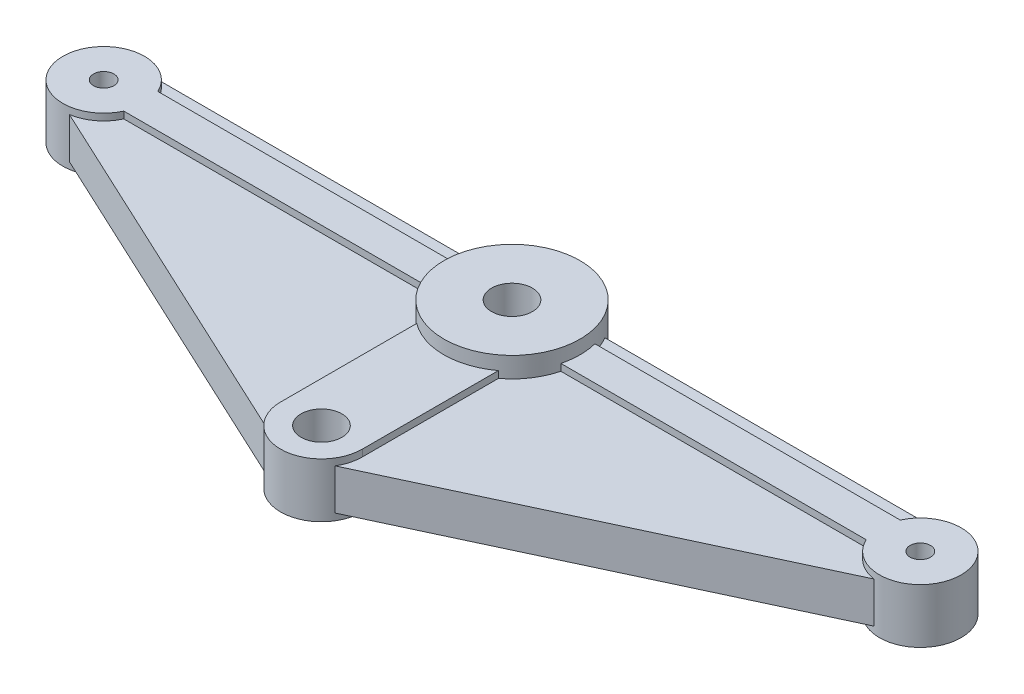
ISO-10303-21;
HEADER;
FILE_DESCRIPTION(('STEP AP214'),'2;1');
FILE_NAME('part.step','',(''),(''),'','','');
FILE_SCHEMA(('AUTOMOTIVE_DESIGN { 1 0 10303 214 1 1 1 1 }'));
ENDSEC;
DATA;
#1=APPLICATION_CONTEXT('core data for automotive mechanical design processes');
#2=APPLICATION_PROTOCOL_DEFINITION('international standard','automotive_design',2000,#1);
#3=PRODUCT_CONTEXT('',#1,'mechanical');
#4=PRODUCT('Part','Part','',(#3));
#5=PRODUCT_RELATED_PRODUCT_CATEGORY('part','',(#4));
#6=PRODUCT_DEFINITION_FORMATION('','',#4);
#7=PRODUCT_DEFINITION_CONTEXT('part definition',#1,'design');
#8=PRODUCT_DEFINITION('design','',#6,#7);
#9=PRODUCT_DEFINITION_SHAPE('','',#8);
#10=(LENGTH_UNIT() NAMED_UNIT(*) SI_UNIT(.MILLI.,.METRE.));
#11=(NAMED_UNIT(*) PLANE_ANGLE_UNIT() SI_UNIT($,.RADIAN.));
#12=(NAMED_UNIT(*) SI_UNIT($,.STERADIAN.) SOLID_ANGLE_UNIT());
#13=UNCERTAINTY_MEASURE_WITH_UNIT(LENGTH_MEASURE(1.E-05),#10,'distance_accuracy_value','');
#14=(GEOMETRIC_REPRESENTATION_CONTEXT(3) GLOBAL_UNCERTAINTY_ASSIGNED_CONTEXT((#13)) GLOBAL_UNIT_ASSIGNED_CONTEXT((#10,
#11,#12)) REPRESENTATION_CONTEXT('',''));
#15=CARTESIAN_POINT('',(0.,0.,0.));
#16=DIRECTION('',(0.,0.,1.));
#17=DIRECTION('',(1.,0.,0.));
#18=AXIS2_PLACEMENT_3D('',#15,#16,#17);
#19=CARTESIAN_POINT('',(-30.,1.5,0.));
#20=DIRECTION('',(0.,1.,0.));
#21=DIRECTION('',(0.,0.,1.));
#22=AXIS2_PLACEMENT_3D('',#19,#20,#21);
#23=PLANE('',#22);
#24=DIRECTION('',(1.,0.,0.));
#25=VECTOR('',#24,1.);
#26=CARTESIAN_POINT('',(-30.,1.5,-1.25));
#27=LINE('',#26,#25);
#28=CARTESIAN_POINT('',(-27.2728219713411,1.5,-1.25));
#29=VERTEX_POINT('',#28);
#30=CARTESIAN_POINT('',(-4.84122918275927,1.5,-1.25));
#31=VERTEX_POINT('',#30);
#32=EDGE_CURVE('E334',#29,#31,#27,.T.);
#33=ORIENTED_EDGE('',*,*,#32,.T.);
#34=CARTESIAN_POINT('',(0.,1.5,0.));
#35=DIRECTION('',(0.,1.,0.));
#36=DIRECTION('',(0.,0.,1.));
#37=AXIS2_PLACEMENT_3D('',#34,#35,#36);
#38=CIRCLE('',#37,5.);
#39=CARTESIAN_POINT('',(-4.33012701892219,1.5,-2.50000000000001));
#40=VERTEX_POINT('',#39);
#41=EDGE_CURVE('E492',#31,#40,#38,.F.);
#42=ORIENTED_EDGE('',*,*,#41,.T.);
#43=DIRECTION('',(-1.,0.,0.));
#44=VECTOR('',#43,1.);
#45=CARTESIAN_POINT('',(-30.,1.5,-2.50000000000001));
#46=LINE('',#45,#44);
#47=CARTESIAN_POINT('',(-28.3416876048223,1.5,-2.50000000000001));
#48=VERTEX_POINT('',#47);
#49=EDGE_CURVE('E275',#40,#48,#46,.T.);
#50=ORIENTED_EDGE('',*,*,#49,.T.);
#51=CARTESIAN_POINT('',(-30.,1.5,0.));
#52=DIRECTION('',(0.,1.,0.));
#53=DIRECTION('',(0.,0.,1.));
#54=AXIS2_PLACEMENT_3D('',#51,#52,#53);
#55=CIRCLE('',#54,3.);
#56=EDGE_CURVE('E353',#48,#29,#55,.F.);
#57=ORIENTED_EDGE('',*,*,#56,.T.);
#58=EDGE_LOOP('',(#33,#42,#50,#57));
#59=FACE_BOUND('',#58,.T.);
#60=ADVANCED_FACE('F31',(#59),#23,.T.);
#61=CARTESIAN_POINT('',(28.3416876048223,1.5,-2.50000000000001));
#62=VERTEX_POINT('',#61);
#63=CARTESIAN_POINT('',(4.33012701892219,1.5,-2.50000000000001));
#64=VERTEX_POINT('',#63);
#65=EDGE_CURVE('E276',#62,#64,#46,.T.);
#66=ORIENTED_EDGE('',*,*,#65,.T.);
#67=CARTESIAN_POINT('',(4.84122918275927,1.5,-1.25));
#68=VERTEX_POINT('',#67);
#69=EDGE_CURVE('E478',#64,#68,#38,.F.);
#70=ORIENTED_EDGE('',*,*,#69,.T.);
#71=DIRECTION('',(1.,0.,0.));
#72=VECTOR('',#71,1.);
#73=CARTESIAN_POINT('',(-30.,1.5,-1.25));
#74=LINE('',#73,#72);
#75=CARTESIAN_POINT('',(27.2728219713411,1.5,-1.25));
#76=VERTEX_POINT('',#75);
#77=EDGE_CURVE('E339',#68,#76,#74,.T.);
#78=ORIENTED_EDGE('',*,*,#77,.T.);
#79=CARTESIAN_POINT('',(30.,1.5,0.));
#80=DIRECTION('',(0.,1.,0.));
#81=DIRECTION('',(0.,0.,1.));
#82=AXIS2_PLACEMENT_3D('',#79,#80,#81);
#83=CIRCLE('',#82,3.);
#84=EDGE_CURVE('E344',#76,#62,#83,.F.);
#85=ORIENTED_EDGE('',*,*,#84,.T.);
#86=EDGE_LOOP('',(#66,#70,#78,#85));
#87=FACE_BOUND('',#86,.T.);
#88=ADVANCED_FACE('F530',(#87),#23,.T.);
#89=CARTESIAN_POINT('',(-30.,-1.5,0.));
#90=DIRECTION('',(0.,1.,0.));
#91=DIRECTION('',(0.,0.,1.));
#92=AXIS2_PLACEMENT_3D('',#89,#90,#91);
#93=PLANE('',#92);
#94=CARTESIAN_POINT('',(0.,-1.5,0.));
#95=DIRECTION('',(0.,1.,0.));
#96=DIRECTION('',(0.,0.,1.));
#97=AXIS2_PLACEMENT_3D('',#94,#95,#96);
#98=CIRCLE('',#97,5.);
#99=CARTESIAN_POINT('',(-4.84122918275927,-1.5,-1.25));
#100=VERTEX_POINT('',#99);
#101=CARTESIAN_POINT('',(-4.33012701892219,-1.5,-2.50000000000001));
#102=VERTEX_POINT('',#101);
#103=EDGE_CURVE('E483',#100,#102,#98,.F.);
#104=ORIENTED_EDGE('',*,*,#103,.F.);
#105=DIRECTION('',(1.,0.,0.));
#106=VECTOR('',#105,1.);
#107=CARTESIAN_POINT('',(-30.,-1.5,-1.25));
#108=LINE('',#107,#106);
#109=CARTESIAN_POINT('',(-27.2728219713411,-1.5,-1.25));
#110=VERTEX_POINT('',#109);
#111=EDGE_CURVE('E327',#110,#100,#108,.T.);
#112=ORIENTED_EDGE('',*,*,#111,.F.);
#113=CARTESIAN_POINT('',(-30.,-1.5,0.));
#114=DIRECTION('',(0.,1.,0.));
#115=DIRECTION('',(0.,0.,1.));
#116=AXIS2_PLACEMENT_3D('',#113,#114,#115);
#117=CIRCLE('',#116,3.);
#118=CARTESIAN_POINT('',(-28.3416876048223,-1.5,-2.50000000000001));
#119=VERTEX_POINT('',#118);
#120=EDGE_CURVE('E317',#119,#110,#117,.F.);
#121=ORIENTED_EDGE('',*,*,#120,.F.);
#122=DIRECTION('',(-1.,0.,0.));
#123=VECTOR('',#122,1.);
#124=CARTESIAN_POINT('',(-30.,-1.5,-2.50000000000001));
#125=LINE('',#124,#123);
#126=EDGE_CURVE('E266',#102,#119,#125,.T.);
#127=ORIENTED_EDGE('',*,*,#126,.F.);
#128=EDGE_LOOP('',(#104,#112,#121,#127));
#129=FACE_BOUND('',#128,.T.);
#130=ADVANCED_FACE('F536',(#129),#93,.F.);
#131=CARTESIAN_POINT('',(4.33012701892219,-1.5,-2.50000000000001));
#132=VERTEX_POINT('',#131);
#133=CARTESIAN_POINT('',(4.84122918275927,-1.5,-1.25));
#134=VERTEX_POINT('',#133);
#135=EDGE_CURVE('E472',#132,#134,#98,.F.);
#136=ORIENTED_EDGE('',*,*,#135,.F.);
#137=CARTESIAN_POINT('',(28.3416876048223,-1.5,-2.50000000000001));
#138=VERTEX_POINT('',#137);
#139=EDGE_CURVE('E267',#138,#132,#125,.T.);
#140=ORIENTED_EDGE('',*,*,#139,.F.);
#141=CARTESIAN_POINT('',(30.,-1.5,0.));
#142=DIRECTION('',(0.,1.,0.));
#143=DIRECTION('',(0.,0.,1.));
#144=AXIS2_PLACEMENT_3D('',#141,#142,#143);
#145=CIRCLE('',#144,3.);
#146=CARTESIAN_POINT('',(27.2728219713411,-1.5,-1.25));
#147=VERTEX_POINT('',#146);
#148=EDGE_CURVE('E341',#147,#138,#145,.F.);
#149=ORIENTED_EDGE('',*,*,#148,.F.);
#150=DIRECTION('',(1.,0.,0.));
#151=VECTOR('',#150,1.);
#152=CARTESIAN_POINT('',(-30.,-1.5,-1.25));
#153=LINE('',#152,#151);
#154=EDGE_CURVE('E337',#134,#147,#153,.T.);
#155=ORIENTED_EDGE('',*,*,#154,.F.);
#156=EDGE_LOOP('',(#136,#140,#149,#155));
#157=FACE_BOUND('',#156,.T.);
#158=ADVANCED_FACE('F553',(#157),#93,.F.);
#159=CARTESIAN_POINT('',(-30.,1.5,-2.50000000000001));
#160=DIRECTION('',(0.,0.,1.));
#161=DIRECTION('',(1.,0.,0.));
#162=AXIS2_PLACEMENT_3D('',#159,#160,#161);
#163=PLANE('',#162);
#164=DIRECTION('',(0.,-1.,0.));
#165=VECTOR('',#164,1.);
#166=CARTESIAN_POINT('',(-4.33012701892219,3.,-2.50000000000001));
#167=LINE('',#166,#165);
#168=EDGE_CURVE('E485',#102,#40,#167,.F.);
#169=ORIENTED_EDGE('',*,*,#168,.F.);
#170=ORIENTED_EDGE('',*,*,#126,.T.);
#171=DIRECTION('',(0.,-1.,0.));
#172=VECTOR('',#171,1.);
#173=CARTESIAN_POINT('',(-28.3416876048223,2.,-2.50000000000001));
#174=LINE('',#173,#172);
#175=EDGE_CURVE('E282',#48,#119,#174,.T.);
#176=ORIENTED_EDGE('',*,*,#175,.F.);
#177=ORIENTED_EDGE('',*,*,#49,.F.);
#178=EDGE_LOOP('',(#169,#170,#176,#177));
#179=FACE_BOUND('',#178,.T.);
#180=ADVANCED_FACE('F564',(#179),#163,.F.);
#181=DIRECTION('',(0.,-1.,0.));
#182=VECTOR('',#181,1.);
#183=CARTESIAN_POINT('',(4.33012701892219,3.,-2.50000000000001));
#184=LINE('',#183,#182);
#185=EDGE_CURVE('E473',#64,#132,#184,.T.);
#186=ORIENTED_EDGE('',*,*,#185,.F.);
#187=ORIENTED_EDGE('',*,*,#65,.F.);
#188=DIRECTION('',(0.,-1.,0.));
#189=VECTOR('',#188,1.);
#190=CARTESIAN_POINT('',(28.3416876048223,2.,-2.50000000000001));
#191=LINE('',#190,#189);
#192=EDGE_CURVE('E279',#138,#62,#191,.F.);
#193=ORIENTED_EDGE('',*,*,#192,.F.);
#194=ORIENTED_EDGE('',*,*,#139,.T.);
#195=EDGE_LOOP('',(#186,#187,#193,#194));
#196=FACE_BOUND('',#195,.T.);
#197=ADVANCED_FACE('F570',(#196),#163,.F.);
#198=CARTESIAN_POINT('',(-27.2728219713411,2.,1.25));
#199=DIRECTION('',(0.,0.,-1.));
#200=DIRECTION('',(-1.,0.,0.));
#201=AXIS2_PLACEMENT_3D('',#198,#199,#200);
#202=PLANE('',#201);
#203=DIRECTION('',(0.,-1.,0.));
#204=VECTOR('',#203,1.);
#205=CARTESIAN_POINT('',(-4.84122918275927,3.,1.25));
#206=LINE('',#205,#204);
#207=CARTESIAN_POINT('',(-4.84122918275927,-1.5,1.25));
#208=VERTEX_POINT('',#207);
#209=CARTESIAN_POINT('',(-4.84122918275927,-2.,1.25));
#210=VERTEX_POINT('',#209);
#211=EDGE_CURVE('E304',#208,#210,#206,.T.);
#212=ORIENTED_EDGE('',*,*,#211,.F.);
#213=DIRECTION('',(-1.,0.,0.));
#214=VECTOR('',#213,1.);
#215=CARTESIAN_POINT('',(-30.,-1.5,1.25));
#216=LINE('',#215,#214);
#217=CARTESIAN_POINT('',(-27.2728219713411,-1.5,1.25));
#218=VERTEX_POINT('',#217);
#219=EDGE_CURVE('E39',#208,#218,#216,.T.);
#220=ORIENTED_EDGE('',*,*,#219,.T.);
#221=DIRECTION('',(0.,-1.,0.));
#222=VECTOR('',#221,1.);
#223=CARTESIAN_POINT('',(-27.2728219713411,2.,1.25));
#224=LINE('',#223,#222);
#225=CARTESIAN_POINT('',(-27.2728219713411,-2.,1.25));
#226=VERTEX_POINT('',#225);
#227=EDGE_CURVE('E302',#218,#226,#224,.T.);
#228=ORIENTED_EDGE('',*,*,#227,.T.);
#229=DIRECTION('',(1.,0.,0.));
#230=VECTOR('',#229,1.);
#231=CARTESIAN_POINT('',(-27.2728219713411,-2.,1.25));
#232=LINE('',#231,#230);
#233=EDGE_CURVE('E437',#226,#210,#232,.T.);
#234=ORIENTED_EDGE('',*,*,#233,.T.);
#235=EDGE_LOOP('',(#212,#220,#228,#234));
#236=FACE_BOUND('',#235,.T.);
#237=ADVANCED_FACE('F299',(#236),#202,.F.);
#238=CARTESIAN_POINT('',(-3.,2.,1.25));
#239=DIRECTION('',(1.,0.,0.));
#240=DIRECTION('',(0.,0.,-1.));
#241=AXIS2_PLACEMENT_3D('',#238,#239,#240);
#242=PLANE('',#241);
#243=DIRECTION('',(0.,-1.,0.));
#244=VECTOR('',#243,1.);
#245=CARTESIAN_POINT('',(-3.,3.,4.));
#246=LINE('',#245,#244);
#247=CARTESIAN_POINT('',(-3.,-2.,4.));
#248=VERTEX_POINT('',#247);
#249=CARTESIAN_POINT('',(-3.,-1.5,4.));
#250=VERTEX_POINT('',#249);
#251=EDGE_CURVE('E465',#248,#250,#246,.F.);
#252=ORIENTED_EDGE('',*,*,#251,.F.);
#253=DIRECTION('',(0.,0.,1.));
#254=VECTOR('',#253,1.);
#255=CARTESIAN_POINT('',(-3.,-2.,1.25));
#256=LINE('',#255,#254);
#257=CARTESIAN_POINT('',(-3.,-2.,14.));
#258=VERTEX_POINT('',#257);
#259=EDGE_CURVE('E379',#248,#258,#256,.T.);
#260=ORIENTED_EDGE('',*,*,#259,.T.);
#261=DIRECTION('',(0.,-1.,0.));
#262=VECTOR('',#261,1.);
#263=CARTESIAN_POINT('',(-3.,2.,14.));
#264=LINE('',#263,#262);
#265=CARTESIAN_POINT('',(-3.,-1.5,14.));
#266=VERTEX_POINT('',#265);
#267=EDGE_CURVE('E328',#266,#258,#264,.T.);
#268=ORIENTED_EDGE('',*,*,#267,.F.);
#269=DIRECTION('',(0.,0.,-1.));
#270=VECTOR('',#269,1.);
#271=CARTESIAN_POINT('',(-3.,-1.5,0.));
#272=LINE('',#271,#270);
#273=EDGE_CURVE('E293',#266,#250,#272,.T.);
#274=ORIENTED_EDGE('',*,*,#273,.T.);
#275=EDGE_LOOP('',(#252,#260,#268,#274));
#276=FACE_BOUND('',#275,.T.);
#277=ADVANCED_FACE('F377',(#276),#242,.F.);
#278=CARTESIAN_POINT('',(3.,2.,1.25));
#279=DIRECTION('',(-1.,0.,0.));
#280=DIRECTION('',(0.,0.,1.));
#281=AXIS2_PLACEMENT_3D('',#278,#279,#280);
#282=PLANE('',#281);
#283=DIRECTION('',(0.,-1.,0.));
#284=VECTOR('',#283,1.);
#285=CARTESIAN_POINT('',(3.,3.,4.));
#286=LINE('',#285,#284);
#287=CARTESIAN_POINT('',(3.,-1.5,4.));
#288=VERTEX_POINT('',#287);
#289=CARTESIAN_POINT('',(3.,-2.,4.));
#290=VERTEX_POINT('',#289);
#291=EDGE_CURVE('E460',#288,#290,#286,.T.);
#292=ORIENTED_EDGE('',*,*,#291,.F.);
#293=DIRECTION('',(0.,0.,1.));
#294=VECTOR('',#293,1.);
#295=CARTESIAN_POINT('',(3.,-1.5,0.));
#296=LINE('',#295,#294);
#297=CARTESIAN_POINT('',(3.,-1.5,14.));
#298=VERTEX_POINT('',#297);
#299=EDGE_CURVE('E291',#288,#298,#296,.T.);
#300=ORIENTED_EDGE('',*,*,#299,.T.);
#301=DIRECTION('',(0.,-1.,0.));
#302=VECTOR('',#301,1.);
#303=CARTESIAN_POINT('',(3.,2.,14.));
#304=LINE('',#303,#302);
#305=CARTESIAN_POINT('',(3.,-2.,14.));
#306=VERTEX_POINT('',#305);
#307=EDGE_CURVE('E382',#298,#306,#304,.T.);
#308=ORIENTED_EDGE('',*,*,#307,.T.);
#309=DIRECTION('',(0.,0.,-1.));
#310=VECTOR('',#309,1.);
#311=CARTESIAN_POINT('',(3.,-2.,1.25));
#312=LINE('',#311,#310);
#313=EDGE_CURVE('E431',#306,#290,#312,.T.);
#314=ORIENTED_EDGE('',*,*,#313,.T.);
#315=EDGE_LOOP('',(#292,#300,#308,#314));
#316=FACE_BOUND('',#315,.T.);
#317=ADVANCED_FACE('F604',(#316),#282,.F.);
#318=CARTESIAN_POINT('',(3.,2.,1.25));
#319=DIRECTION('',(0.,0.,-1.));
#320=DIRECTION('',(-1.,0.,0.));
#321=AXIS2_PLACEMENT_3D('',#318,#319,#320);
#322=PLANE('',#321);
#323=DIRECTION('',(0.,-1.,0.));
#324=VECTOR('',#323,1.);
#325=CARTESIAN_POINT('',(4.84122918275927,3.,1.25));
#326=LINE('',#325,#324);
#327=CARTESIAN_POINT('',(4.84122918275927,-2.,1.25));
#328=VERTEX_POINT('',#327);
#329=CARTESIAN_POINT('',(4.84122918275927,-1.5,1.25));
#330=VERTEX_POINT('',#329);
#331=EDGE_CURVE('E462',#328,#330,#326,.F.);
#332=ORIENTED_EDGE('',*,*,#331,.F.);
#333=DIRECTION('',(1.,0.,0.));
#334=VECTOR('',#333,1.);
#335=CARTESIAN_POINT('',(3.,-2.,1.25));
#336=LINE('',#335,#334);
#337=CARTESIAN_POINT('',(27.2728219713411,-2.,1.25));
#338=VERTEX_POINT('',#337);
#339=EDGE_CURVE('E429',#328,#338,#336,.T.);
#340=ORIENTED_EDGE('',*,*,#339,.T.);
#341=DIRECTION('',(0.,-1.,0.));
#342=VECTOR('',#341,1.);
#343=CARTESIAN_POINT('',(27.2728219713411,2.,1.25));
#344=LINE('',#343,#342);
#345=CARTESIAN_POINT('',(27.2728219713411,-1.5,1.25));
#346=VERTEX_POINT('',#345);
#347=EDGE_CURVE('E391',#346,#338,#344,.T.);
#348=ORIENTED_EDGE('',*,*,#347,.F.);
#349=DIRECTION('',(-1.,0.,0.));
#350=VECTOR('',#349,1.);
#351=CARTESIAN_POINT('',(-30.,-1.5,1.25));
#352=LINE('',#351,#350);
#353=EDGE_CURVE('E288',#346,#330,#352,.T.);
#354=ORIENTED_EDGE('',*,*,#353,.T.);
#355=EDGE_LOOP('',(#332,#340,#348,#354));
#356=FACE_BOUND('',#355,.T.);
#357=ADVANCED_FACE('F667',(#356),#322,.F.);
#358=CARTESIAN_POINT('',(0.829156197588851,2.,-1.25));
#359=DIRECTION('',(0.,0.,1.));
#360=DIRECTION('',(1.,0.,0.));
#361=AXIS2_PLACEMENT_3D('',#358,#359,#360);
#362=PLANE('',#361);
#363=DIRECTION('',(0.,-1.,0.));
#364=VECTOR('',#363,1.);
#365=CARTESIAN_POINT('',(4.84122918275927,3.,-1.25));
#366=LINE('',#365,#364);
#367=CARTESIAN_POINT('',(4.84122918275927,-2.,-1.25));
#368=VERTEX_POINT('',#367);
#369=EDGE_CURVE('E468',#134,#368,#366,.T.);
#370=ORIENTED_EDGE('',*,*,#369,.F.);
#371=ORIENTED_EDGE('',*,*,#154,.T.);
#372=DIRECTION('',(0.,-1.,0.));
#373=VECTOR('',#372,1.);
#374=CARTESIAN_POINT('',(27.2728219713411,2.,-1.25));
#375=LINE('',#374,#373);
#376=CARTESIAN_POINT('',(27.2728219713411,-2.,-1.25));
#377=VERTEX_POINT('',#376);
#378=EDGE_CURVE('E395',#147,#377,#375,.T.);
#379=ORIENTED_EDGE('',*,*,#378,.T.);
#380=DIRECTION('',(-1.,0.,0.));
#381=VECTOR('',#380,1.);
#382=CARTESIAN_POINT('',(0.829156197588851,-2.,-1.25));
#383=LINE('',#382,#381);
#384=EDGE_CURVE('E423',#377,#368,#383,.T.);
#385=ORIENTED_EDGE('',*,*,#384,.T.);
#386=EDGE_LOOP('',(#370,#371,#379,#385));
#387=FACE_BOUND('',#386,.T.);
#388=ADVANCED_FACE('F590',(#387),#362,.F.);
#389=CARTESIAN_POINT('',(-27.2728219713411,2.,-1.25));
#390=DIRECTION('',(0.,0.,1.));
#391=DIRECTION('',(1.,0.,0.));
#392=AXIS2_PLACEMENT_3D('',#389,#390,#391);
#393=PLANE('',#392);
#394=DIRECTION('',(0.,-1.,0.));
#395=VECTOR('',#394,1.);
#396=CARTESIAN_POINT('',(-4.84122918275927,3.,-1.25));
#397=LINE('',#396,#395);
#398=CARTESIAN_POINT('',(-4.84122918275927,-2.,-1.25));
#399=VERTEX_POINT('',#398);
#400=EDGE_CURVE('E479',#399,#100,#397,.F.);
#401=ORIENTED_EDGE('',*,*,#400,.F.);
#402=DIRECTION('',(-1.,0.,0.));
#403=VECTOR('',#402,1.);
#404=CARTESIAN_POINT('',(-27.2728219713411,-2.,-1.25));
#405=LINE('',#404,#403);
#406=CARTESIAN_POINT('',(-27.2728219713411,-2.,-1.25));
#407=VERTEX_POINT('',#406);
#408=EDGE_CURVE('E421',#399,#407,#405,.T.);
#409=ORIENTED_EDGE('',*,*,#408,.T.);
#410=DIRECTION('',(0.,-1.,0.));
#411=VECTOR('',#410,1.);
#412=CARTESIAN_POINT('',(-27.2728219713411,2.,-1.25));
#413=LINE('',#412,#411);
#414=EDGE_CURVE('E399',#110,#407,#413,.T.);
#415=ORIENTED_EDGE('',*,*,#414,.F.);
#416=ORIENTED_EDGE('',*,*,#111,.T.);
#417=EDGE_LOOP('',(#401,#409,#415,#416));
#418=FACE_BOUND('',#417,.T.);
#419=ADVANCED_FACE('F560',(#418),#393,.F.);
#420=CARTESIAN_POINT('',(-30.,2.,0.));
#421=DIRECTION('',(0.,1.,0.));
#422=DIRECTION('',(0.,0.,1.));
#423=AXIS2_PLACEMENT_3D('',#420,#421,#422);
#424=PLANE('',#423);
#425=CARTESIAN_POINT('',(-30.,2.,0.));
#426=DIRECTION('',(0.,1.,0.));
#427=DIRECTION('',(0.,0.,1.));
#428=AXIS2_PLACEMENT_3D('',#425,#426,#427);
#429=CIRCLE('',#428,0.750000000000002);
#430=CARTESIAN_POINT('',(-30.,2.,0.750000000000002));
#431=VERTEX_POINT('',#430);
#432=EDGE_CURVE('E452',#431,#431,#429,.T.);
#433=ORIENTED_EDGE('',*,*,#432,.F.);
#434=EDGE_LOOP('',(#433));
#435=FACE_BOUND('',#434,.T.);
#436=DIRECTION('',(1.,0.,0.));
#437=VECTOR('',#436,1.);
#438=CARTESIAN_POINT('',(-27.2728219713411,2.,1.25));
#439=LINE('',#438,#437);
#440=CARTESIAN_POINT('',(-27.2728219713411,2.,1.25));
#441=VERTEX_POINT('',#440);
#442=CARTESIAN_POINT('',(-4.84122918275927,2.,1.25));
#443=VERTEX_POINT('',#442);
#444=EDGE_CURVE('E415',#441,#443,#439,.T.);
#445=ORIENTED_EDGE('',*,*,#444,.T.);
#446=CARTESIAN_POINT('',(0.,2.,0.));
#447=DIRECTION('',(0.,1.,0.));
#448=DIRECTION('',(0.,0.,1.));
#449=AXIS2_PLACEMENT_3D('',#446,#447,#448);
#450=CIRCLE('',#449,5.);
#451=CARTESIAN_POINT('',(-4.84122918275927,2.,-1.25));
#452=VERTEX_POINT('',#451);
#453=EDGE_CURVE('E499',#443,#452,#450,.F.);
#454=ORIENTED_EDGE('',*,*,#453,.T.);
#455=DIRECTION('',(-1.,0.,0.));
#456=VECTOR('',#455,1.);
#457=CARTESIAN_POINT('',(-27.2728219713411,2.,-1.25));
#458=LINE('',#457,#456);
#459=CARTESIAN_POINT('',(-27.2728219713411,2.,-1.25));
#460=VERTEX_POINT('',#459);
#461=EDGE_CURVE('E400',#452,#460,#458,.T.);
#462=ORIENTED_EDGE('',*,*,#461,.T.);
#463=CARTESIAN_POINT('',(-30.,2.,0.));
#464=DIRECTION('',(0.,1.,0.));
#465=DIRECTION('',(0.,0.,1.));
#466=AXIS2_PLACEMENT_3D('',#463,#464,#465);
#467=CIRCLE('',#466,3.);
#468=EDGE_CURVE('E418',#460,#441,#467,.T.);
#469=ORIENTED_EDGE('',*,*,#468,.T.);
#470=EDGE_LOOP('',(#445,#454,#462,#469));
#471=FACE_BOUND('',#470,.T.);
#472=ADVANCED_FACE('F623',(#435,#471),#424,.T.);
#473=CARTESIAN_POINT('',(30.,2.,0.));
#474=DIRECTION('',(0.,1.,0.));
#475=DIRECTION('',(0.,0.,1.));
#476=AXIS2_PLACEMENT_3D('',#473,#474,#475);
#477=CIRCLE('',#476,0.750000000000002);
#478=CARTESIAN_POINT('',(30.,2.,0.749999999999995));
#479=VERTEX_POINT('',#478);
#480=EDGE_CURVE('E440',#479,#479,#477,.T.);
#481=ORIENTED_EDGE('',*,*,#480,.F.);
#482=EDGE_LOOP('',(#481));
#483=FACE_BOUND('',#482,.T.);
#484=DIRECTION('',(-1.,0.,0.));
#485=VECTOR('',#484,1.);
#486=CARTESIAN_POINT('',(0.829156197588851,2.,-1.25));
#487=LINE('',#486,#485);
#488=CARTESIAN_POINT('',(27.2728219713411,2.,-1.25));
#489=VERTEX_POINT('',#488);
#490=CARTESIAN_POINT('',(4.84122918275927,2.,-1.25));
#491=VERTEX_POINT('',#490);
#492=EDGE_CURVE('E402',#489,#491,#487,.T.);
#493=ORIENTED_EDGE('',*,*,#492,.T.);
#494=CARTESIAN_POINT('',(4.84122918275927,2.,1.25));
#495=VERTEX_POINT('',#494);
#496=EDGE_CURVE('E487',#491,#495,#450,.F.);
#497=ORIENTED_EDGE('',*,*,#496,.T.);
#498=DIRECTION('',(1.,0.,0.));
#499=VECTOR('',#498,1.);
#500=CARTESIAN_POINT('',(3.,2.,1.25));
#501=LINE('',#500,#499);
#502=CARTESIAN_POINT('',(27.2728219713411,2.,1.25));
#503=VERTEX_POINT('',#502);
#504=EDGE_CURVE('E407',#495,#503,#501,.T.);
#505=ORIENTED_EDGE('',*,*,#504,.T.);
#506=CARTESIAN_POINT('',(30.,2.,0.));
#507=DIRECTION('',(0.,1.,0.));
#508=DIRECTION('',(0.,0.,1.));
#509=AXIS2_PLACEMENT_3D('',#506,#507,#508);
#510=CIRCLE('',#509,3.);
#511=EDGE_CURVE('E405',#503,#489,#510,.T.);
#512=ORIENTED_EDGE('',*,*,#511,.T.);
#513=EDGE_LOOP('',(#493,#497,#505,#512));
#514=FACE_BOUND('',#513,.T.);
#515=ADVANCED_FACE('F620',(#483,#514),#424,.T.);
#516=CARTESIAN_POINT('',(0.,2.,14.));
#517=DIRECTION('',(0.,1.,0.));
#518=DIRECTION('',(0.,0.,1.));
#519=AXIS2_PLACEMENT_3D('',#516,#517,#518);
#520=CIRCLE('',#519,1.5);
#521=CARTESIAN_POINT('',(0.,2.,15.5));
#522=VERTEX_POINT('',#521);
#523=EDGE_CURVE('E446',#522,#522,#520,.T.);
#524=ORIENTED_EDGE('',*,*,#523,.F.);
#525=EDGE_LOOP('',(#524));
#526=FACE_BOUND('',#525,.T.);
#527=DIRECTION('',(0.,0.,-1.));
#528=VECTOR('',#527,1.);
#529=CARTESIAN_POINT('',(3.,2.,1.25));
#530=LINE('',#529,#528);
#531=CARTESIAN_POINT('',(3.,2.,14.));
#532=VERTEX_POINT('',#531);
#533=CARTESIAN_POINT('',(3.,2.,4.));
#534=VERTEX_POINT('',#533);
#535=EDGE_CURVE('E409',#532,#534,#530,.T.);
#536=ORIENTED_EDGE('',*,*,#535,.T.);
#537=CARTESIAN_POINT('',(-3.,2.,4.));
#538=VERTEX_POINT('',#537);
#539=EDGE_CURVE('E500',#534,#538,#450,.F.);
#540=ORIENTED_EDGE('',*,*,#539,.T.);
#541=DIRECTION('',(0.,0.,1.));
#542=VECTOR('',#541,1.);
#543=CARTESIAN_POINT('',(-3.,2.,1.25));
#544=LINE('',#543,#542);
#545=CARTESIAN_POINT('',(-3.,2.,14.));
#546=VERTEX_POINT('',#545);
#547=EDGE_CURVE('E248',#538,#546,#544,.T.);
#548=ORIENTED_EDGE('',*,*,#547,.T.);
#549=CARTESIAN_POINT('',(0.,2.,14.));
#550=DIRECTION('',(0.,1.,0.));
#551=DIRECTION('',(0.,0.,1.));
#552=AXIS2_PLACEMENT_3D('',#549,#550,#551);
#553=CIRCLE('',#552,3.);
#554=EDGE_CURVE('E412',#546,#532,#553,.T.);
#555=ORIENTED_EDGE('',*,*,#554,.T.);
#556=EDGE_LOOP('',(#536,#540,#548,#555));
#557=FACE_BOUND('',#556,.T.);
#558=ADVANCED_FACE('F617',(#526,#557),#424,.T.);
#559=CARTESIAN_POINT('',(-30.,-2.,0.));
#560=DIRECTION('',(0.,1.,0.));
#561=DIRECTION('',(0.,0.,1.));
#562=AXIS2_PLACEMENT_3D('',#559,#560,#561);
#563=PLANE('',#562);
#564=CARTESIAN_POINT('',(-30.,-2.,0.));
#565=DIRECTION('',(0.,1.,0.));
#566=DIRECTION('',(0.,0.,1.));
#567=AXIS2_PLACEMENT_3D('',#564,#565,#566);
#568=CIRCLE('',#567,0.750000000000002);
#569=CARTESIAN_POINT('',(-30.,-2.,0.750000000000002));
#570=VERTEX_POINT('',#569);
#571=EDGE_CURVE('E455',#570,#570,#568,.T.);
#572=ORIENTED_EDGE('',*,*,#571,.T.);
#573=EDGE_LOOP('',(#572));
#574=FACE_BOUND('',#573,.T.);
#575=CARTESIAN_POINT('',(0.,-2.,0.));
#576=DIRECTION('',(0.,1.,0.));
#577=DIRECTION('',(0.,0.,1.));
#578=AXIS2_PLACEMENT_3D('',#575,#576,#577);
#579=CIRCLE('',#578,5.);
#580=EDGE_CURVE('E476',#210,#399,#579,.F.);
#581=ORIENTED_EDGE('',*,*,#580,.F.);
#582=ORIENTED_EDGE('',*,*,#233,.F.);
#583=CARTESIAN_POINT('',(-30.,-2.,0.));
#584=DIRECTION('',(0.,1.,0.));
#585=DIRECTION('',(0.,0.,1.));
#586=AXIS2_PLACEMENT_3D('',#583,#584,#585);
#587=CIRCLE('',#586,3.);
#588=EDGE_CURVE('E322',#407,#226,#587,.T.);
#589=ORIENTED_EDGE('',*,*,#588,.F.);
#590=ORIENTED_EDGE('',*,*,#408,.F.);
#591=EDGE_LOOP('',(#581,#582,#589,#590));
#592=FACE_BOUND('',#591,.T.);
#593=ADVANCED_FACE('F619',(#574,#592),#563,.F.);
#594=CARTESIAN_POINT('',(30.,-2.,0.));
#595=DIRECTION('',(0.,1.,0.));
#596=DIRECTION('',(0.,0.,1.));
#597=AXIS2_PLACEMENT_3D('',#594,#595,#596);
#598=CIRCLE('',#597,0.750000000000002);
#599=CARTESIAN_POINT('',(30.,-2.,0.749999999999995));
#600=VERTEX_POINT('',#599);
#601=EDGE_CURVE('E443',#600,#600,#598,.T.);
#602=ORIENTED_EDGE('',*,*,#601,.T.);
#603=EDGE_LOOP('',(#602));
#604=FACE_BOUND('',#603,.T.);
#605=EDGE_CURVE('E464',#368,#328,#579,.F.);
#606=ORIENTED_EDGE('',*,*,#605,.F.);
#607=ORIENTED_EDGE('',*,*,#384,.F.);
#608=CARTESIAN_POINT('',(30.,-2.,0.));
#609=DIRECTION('',(0.,1.,0.));
#610=DIRECTION('',(0.,0.,1.));
#611=AXIS2_PLACEMENT_3D('',#608,#609,#610);
#612=CIRCLE('',#611,3.);
#613=EDGE_CURVE('E426',#338,#377,#612,.T.);
#614=ORIENTED_EDGE('',*,*,#613,.F.);
#615=ORIENTED_EDGE('',*,*,#339,.F.);
#616=EDGE_LOOP('',(#606,#607,#614,#615));
#617=FACE_BOUND('',#616,.T.);
#618=ADVANCED_FACE('F595',(#604,#617),#563,.F.);
#619=CARTESIAN_POINT('',(0.,-2.,14.));
#620=DIRECTION('',(0.,1.,0.));
#621=DIRECTION('',(0.,0.,1.));
#622=AXIS2_PLACEMENT_3D('',#619,#620,#621);
#623=CIRCLE('',#622,1.5);
#624=CARTESIAN_POINT('',(0.,-2.,15.5));
#625=VERTEX_POINT('',#624);
#626=EDGE_CURVE('E449',#625,#625,#623,.T.);
#627=ORIENTED_EDGE('',*,*,#626,.T.);
#628=EDGE_LOOP('',(#627));
#629=FACE_BOUND('',#628,.T.);
#630=EDGE_CURVE('E467',#290,#248,#579,.F.);
#631=ORIENTED_EDGE('',*,*,#630,.F.);
#632=ORIENTED_EDGE('',*,*,#313,.F.);
#633=CARTESIAN_POINT('',(0.,-2.,14.));
#634=DIRECTION('',(0.,1.,0.));
#635=DIRECTION('',(0.,0.,1.));
#636=AXIS2_PLACEMENT_3D('',#633,#634,#635);
#637=CIRCLE('',#636,3.);
#638=EDGE_CURVE('E434',#258,#306,#637,.T.);
#639=ORIENTED_EDGE('',*,*,#638,.F.);
#640=ORIENTED_EDGE('',*,*,#259,.F.);
#641=EDGE_LOOP('',(#631,#632,#639,#640));
#642=FACE_BOUND('',#641,.T.);
#643=ADVANCED_FACE('F600',(#629,#642),#563,.F.);
#644=DIRECTION('',(0.,-1.,0.));
#645=VECTOR('',#644,1.);
#646=CARTESIAN_POINT('',(-4.84122918275927,3.,1.25));
#647=LINE('',#646,#645);
#648=CARTESIAN_POINT('',(-4.84122918275927,1.5,1.25));
#649=VERTEX_POINT('',#648);
#650=EDGE_CURVE('E46',#443,#649,#647,.T.);
#651=ORIENTED_EDGE('',*,*,#650,.F.);
#652=ORIENTED_EDGE('',*,*,#444,.F.);
#653=CARTESIAN_POINT('',(-27.2728219713411,1.5,1.25));
#654=VERTEX_POINT('',#653);
#655=EDGE_CURVE('E323',#441,#654,#224,.T.);
#656=ORIENTED_EDGE('',*,*,#655,.T.);
#657=DIRECTION('',(-1.,0.,0.));
#658=VECTOR('',#657,1.);
#659=CARTESIAN_POINT('',(-30.,1.5,1.25));
#660=LINE('',#659,#658);
#661=EDGE_CURVE('E52',#649,#654,#660,.T.);
#662=ORIENTED_EDGE('',*,*,#661,.F.);
#663=EDGE_LOOP('',(#651,#652,#656,#662));
#664=FACE_BOUND('',#663,.T.);
#665=ADVANCED_FACE('F645',(#664),#202,.F.);
#666=DIRECTION('',(0.,-1.,0.));
#667=VECTOR('',#666,1.);
#668=CARTESIAN_POINT('',(-3.,3.,4.));
#669=LINE('',#668,#667);
#670=CARTESIAN_POINT('',(-3.,1.5,4.));
#671=VERTEX_POINT('',#670);
#672=EDGE_CURVE('E238',#671,#538,#669,.F.);
#673=ORIENTED_EDGE('',*,*,#672,.F.);
#674=DIRECTION('',(0.,0.,-1.));
#675=VECTOR('',#674,1.);
#676=CARTESIAN_POINT('',(-3.,1.5,0.));
#677=LINE('',#676,#675);
#678=CARTESIAN_POINT('',(-3.,1.5,14.));
#679=VERTEX_POINT('',#678);
#680=EDGE_CURVE('E246',#679,#671,#677,.T.);
#681=ORIENTED_EDGE('',*,*,#680,.F.);
#682=EDGE_CURVE('E324',#546,#679,#264,.T.);
#683=ORIENTED_EDGE('',*,*,#682,.F.);
#684=ORIENTED_EDGE('',*,*,#547,.F.);
#685=EDGE_LOOP('',(#673,#681,#683,#684));
#686=FACE_BOUND('',#685,.T.);
#687=ADVANCED_FACE('F244',(#686),#242,.F.);
#688=DIRECTION('',(0.,-1.,0.));
#689=VECTOR('',#688,1.);
#690=CARTESIAN_POINT('',(3.,3.,4.));
#691=LINE('',#690,#689);
#692=CARTESIAN_POINT('',(3.,1.5,4.));
#693=VERTEX_POINT('',#692);
#694=EDGE_CURVE('E495',#534,#693,#691,.T.);
#695=ORIENTED_EDGE('',*,*,#694,.F.);
#696=ORIENTED_EDGE('',*,*,#535,.F.);
#697=CARTESIAN_POINT('',(3.,1.5,14.));
#698=VERTEX_POINT('',#697);
#699=EDGE_CURVE('E380',#532,#698,#304,.T.);
#700=ORIENTED_EDGE('',*,*,#699,.T.);
#701=DIRECTION('',(0.,0.,1.));
#702=VECTOR('',#701,1.);
#703=CARTESIAN_POINT('',(3.,1.5,0.));
#704=LINE('',#703,#702);
#705=EDGE_CURVE('E255',#693,#698,#704,.T.);
#706=ORIENTED_EDGE('',*,*,#705,.F.);
#707=EDGE_LOOP('',(#695,#696,#700,#706));
#708=FACE_BOUND('',#707,.T.);
#709=ADVANCED_FACE('F615',(#708),#282,.F.);
#710=DIRECTION('',(0.,-1.,0.));
#711=VECTOR('',#710,1.);
#712=CARTESIAN_POINT('',(4.84122918275927,3.,1.25));
#713=LINE('',#712,#711);
#714=CARTESIAN_POINT('',(4.84122918275927,1.5,1.25));
#715=VERTEX_POINT('',#714);
#716=EDGE_CURVE('E488',#715,#495,#713,.F.);
#717=ORIENTED_EDGE('',*,*,#716,.F.);
#718=DIRECTION('',(-1.,0.,0.));
#719=VECTOR('',#718,1.);
#720=CARTESIAN_POINT('',(-30.,1.5,1.25));
#721=LINE('',#720,#719);
#722=CARTESIAN_POINT('',(27.2728219713411,1.5,1.25));
#723=VERTEX_POINT('',#722);
#724=EDGE_CURVE('E259',#723,#715,#721,.T.);
#725=ORIENTED_EDGE('',*,*,#724,.F.);
#726=EDGE_CURVE('E387',#503,#723,#344,.T.);
#727=ORIENTED_EDGE('',*,*,#726,.F.);
#728=ORIENTED_EDGE('',*,*,#504,.F.);
#729=EDGE_LOOP('',(#717,#725,#727,#728));
#730=FACE_BOUND('',#729,.T.);
#731=ADVANCED_FACE('F671',(#730),#322,.F.);
#732=DIRECTION('',(0.,-1.,0.));
#733=VECTOR('',#732,1.);
#734=CARTESIAN_POINT('',(4.84122918275927,3.,-1.25));
#735=LINE('',#734,#733);
#736=EDGE_CURVE('E481',#491,#68,#735,.T.);
#737=ORIENTED_EDGE('',*,*,#736,.F.);
#738=ORIENTED_EDGE('',*,*,#492,.F.);
#739=EDGE_CURVE('E392',#489,#76,#375,.T.);
#740=ORIENTED_EDGE('',*,*,#739,.T.);
#741=ORIENTED_EDGE('',*,*,#77,.F.);
#742=EDGE_LOOP('',(#737,#738,#740,#741));
#743=FACE_BOUND('',#742,.T.);
#744=ADVANCED_FACE('F557',(#743),#362,.F.);
#745=DIRECTION('',(0.,-1.,0.));
#746=VECTOR('',#745,1.);
#747=CARTESIAN_POINT('',(-4.84122918275927,3.,-1.25));
#748=LINE('',#747,#746);
#749=EDGE_CURVE('E497',#31,#452,#748,.F.);
#750=ORIENTED_EDGE('',*,*,#749,.F.);
#751=ORIENTED_EDGE('',*,*,#32,.F.);
#752=EDGE_CURVE('E396',#460,#29,#413,.T.);
#753=ORIENTED_EDGE('',*,*,#752,.F.);
#754=ORIENTED_EDGE('',*,*,#461,.F.);
#755=EDGE_LOOP('',(#750,#751,#753,#754));
#756=FACE_BOUND('',#755,.T.);
#757=ADVANCED_FACE('F551',(#756),#393,.F.);
#758=CARTESIAN_POINT('',(0.,-1.5,0.));
#759=DIRECTION('',(0.,1.,0.));
#760=DIRECTION('',(0.,0.,1.));
#761=AXIS2_PLACEMENT_3D('',#758,#759,#760);
#762=CIRCLE('',#761,5.);
#763=EDGE_CURVE('E458',#330,#288,#762,.F.);
#764=ORIENTED_EDGE('',*,*,#763,.F.);
#765=ORIENTED_EDGE('',*,*,#353,.F.);
#766=CARTESIAN_POINT('',(29.5544789299726,-1.5,2.96673405888724));
#767=VERTEX_POINT('',#766);
#768=EDGE_CURVE('E345',#767,#346,#145,.F.);
#769=ORIENTED_EDGE('',*,*,#768,.F.);
#770=DIRECTION('',(0.906183139995265,0.,-0.422885465331124));
#771=VECTOR('',#770,1.);
#772=CARTESIAN_POINT('',(31.0572136633278,-1.5,2.26545784998814));
#773=LINE('',#772,#771);
#774=CARTESIAN_POINT('',(2.55994839668302,-1.5,15.5641816410891));
#775=VERTEX_POINT('',#774);
#776=EDGE_CURVE('E264',#775,#767,#773,.T.);
#777=ORIENTED_EDGE('',*,*,#776,.F.);
#778=CARTESIAN_POINT('',(0.,-1.5,14.));
#779=DIRECTION('',(0.,1.,0.));
#780=DIRECTION('',(0.,0.,1.));
#781=AXIS2_PLACEMENT_3D('',#778,#779,#780);
#782=CIRCLE('',#781,3.);
#783=EDGE_CURVE('E356',#298,#775,#782,.F.);
#784=ORIENTED_EDGE('',*,*,#783,.F.);
#785=ORIENTED_EDGE('',*,*,#299,.F.);
#786=EDGE_LOOP('',(#764,#765,#769,#777,#784,#785));
#787=FACE_BOUND('',#786,.T.);
#788=ADVANCED_FACE('F546',(#787),#93,.F.);
#789=ORIENTED_EDGE('',*,*,#724,.T.);
#790=CARTESIAN_POINT('',(0.,1.5,0.));
#791=DIRECTION('',(0.,1.,0.));
#792=DIRECTION('',(0.,0.,1.));
#793=AXIS2_PLACEMENT_3D('',#790,#791,#792);
#794=CIRCLE('',#793,5.);
#795=EDGE_CURVE('E490',#715,#693,#794,.F.);
#796=ORIENTED_EDGE('',*,*,#795,.T.);
#797=ORIENTED_EDGE('',*,*,#705,.T.);
#798=CARTESIAN_POINT('',(0.,1.5,14.));
#799=DIRECTION('',(0.,1.,0.));
#800=DIRECTION('',(0.,0.,1.));
#801=AXIS2_PLACEMENT_3D('',#798,#799,#800);
#802=CIRCLE('',#801,3.);
#803=CARTESIAN_POINT('',(2.55994839668302,1.5,15.5641816410891));
#804=VERTEX_POINT('',#803);
#805=EDGE_CURVE('E359',#698,#804,#802,.F.);
#806=ORIENTED_EDGE('',*,*,#805,.T.);
#807=DIRECTION('',(0.906183139995265,0.,-0.422885465331124));
#808=VECTOR('',#807,1.);
#809=CARTESIAN_POINT('',(31.0572136633278,1.5,2.26545784998814));
#810=LINE('',#809,#808);
#811=CARTESIAN_POINT('',(29.5544789299726,1.5,2.96673405888724));
#812=VERTEX_POINT('',#811);
#813=EDGE_CURVE('E272',#804,#812,#810,.T.);
#814=ORIENTED_EDGE('',*,*,#813,.T.);
#815=EDGE_CURVE('E349',#812,#723,#83,.F.);
#816=ORIENTED_EDGE('',*,*,#815,.T.);
#817=EDGE_LOOP('',(#789,#796,#797,#806,#814,#816));
#818=FACE_BOUND('',#817,.T.);
#819=ADVANCED_FACE('F538',(#818),#23,.T.);
#820=CARTESIAN_POINT('',(0.,-1.5,0.));
#821=DIRECTION('',(0.,1.,0.));
#822=DIRECTION('',(0.,0.,1.));
#823=AXIS2_PLACEMENT_3D('',#820,#821,#822);
#824=CIRCLE('',#823,5.);
#825=EDGE_CURVE('E470',#250,#208,#824,.F.);
#826=ORIENTED_EDGE('',*,*,#825,.F.);
#827=ORIENTED_EDGE('',*,*,#273,.F.);
#828=CARTESIAN_POINT('',(-2.55994839668301,-1.5,15.5641816410891));
#829=VERTEX_POINT('',#828);
#830=EDGE_CURVE('E360',#829,#266,#782,.F.);
#831=ORIENTED_EDGE('',*,*,#830,.F.);
#832=DIRECTION('',(0.906183139995265,0.,0.422885465331124));
#833=VECTOR('',#832,1.);
#834=CARTESIAN_POINT('',(-31.0572136633278,-1.5,2.26545784998815));
#835=LINE('',#834,#833);
#836=CARTESIAN_POINT('',(-29.5544789299726,-1.5,2.96673405888725));
#837=VERTEX_POINT('',#836);
#838=EDGE_CURVE('E257',#837,#829,#835,.T.);
#839=ORIENTED_EDGE('',*,*,#838,.F.);
#840=EDGE_CURVE('E309',#218,#837,#117,.F.);
#841=ORIENTED_EDGE('',*,*,#840,.F.);
#842=ORIENTED_EDGE('',*,*,#219,.F.);
#843=EDGE_LOOP('',(#826,#827,#831,#839,#841,#842));
#844=FACE_BOUND('',#843,.T.);
#845=ADVANCED_FACE('F310',(#844),#93,.F.);
#846=ORIENTED_EDGE('',*,*,#680,.T.);
#847=CARTESIAN_POINT('',(0.,1.5,0.));
#848=DIRECTION('',(0.,1.,0.));
#849=DIRECTION('',(0.,0.,1.));
#850=AXIS2_PLACEMENT_3D('',#847,#848,#849);
#851=CIRCLE('',#850,5.);
#852=EDGE_CURVE('E11',#671,#649,#851,.F.);
#853=ORIENTED_EDGE('',*,*,#852,.T.);
#854=ORIENTED_EDGE('',*,*,#661,.T.);
#855=CARTESIAN_POINT('',(-29.5544789299726,1.5,2.96673405888725));
#856=VERTEX_POINT('',#855);
#857=EDGE_CURVE('E314',#654,#856,#55,.F.);
#858=ORIENTED_EDGE('',*,*,#857,.T.);
#859=DIRECTION('',(0.906183139995265,0.,0.422885465331124));
#860=VECTOR('',#859,1.);
#861=CARTESIAN_POINT('',(-31.0572136633278,1.5,2.26545784998815));
#862=LINE('',#861,#860);
#863=CARTESIAN_POINT('',(-2.55994839668302,1.5,15.5641816410891));
#864=VERTEX_POINT('',#863);
#865=EDGE_CURVE('E270',#856,#864,#862,.T.);
#866=ORIENTED_EDGE('',*,*,#865,.T.);
#867=EDGE_CURVE('E254',#864,#679,#802,.F.);
#868=ORIENTED_EDGE('',*,*,#867,.T.);
#869=EDGE_LOOP('',(#846,#853,#854,#858,#866,#868));
#870=FACE_BOUND('',#869,.T.);
#871=ADVANCED_FACE('F251',(#870),#23,.T.);
#872=CARTESIAN_POINT('',(-30.,2.,0.));
#873=DIRECTION('',(0.,-1.,0.));
#874=DIRECTION('',(0.,0.,-1.));
#875=AXIS2_PLACEMENT_3D('',#872,#873,#874);
#876=CYLINDRICAL_SURFACE('',#875,3.);
#877=ORIENTED_EDGE('',*,*,#857,.F.);
#878=ORIENTED_EDGE('',*,*,#655,.F.);
#879=ORIENTED_EDGE('',*,*,#468,.F.);
#880=ORIENTED_EDGE('',*,*,#752,.T.);
#881=ORIENTED_EDGE('',*,*,#56,.F.);
#882=ORIENTED_EDGE('',*,*,#175,.T.);
#883=ORIENTED_EDGE('',*,*,#120,.T.);
#884=ORIENTED_EDGE('',*,*,#414,.T.);
#885=ORIENTED_EDGE('',*,*,#588,.T.);
#886=ORIENTED_EDGE('',*,*,#227,.F.);
#887=ORIENTED_EDGE('',*,*,#840,.T.);
#888=DIRECTION('',(0.,-1.,0.));
#889=VECTOR('',#888,1.);
#890=CARTESIAN_POINT('',(-29.5544789299726,2.,2.96673405888725));
#891=LINE('',#890,#889);
#892=EDGE_CURVE('E315',#837,#856,#891,.F.);
#893=ORIENTED_EDGE('',*,*,#892,.T.);
#894=EDGE_LOOP('',(#877,#878,#879,#880,#881,#882,#883,#884,#885,#886,#887,#893));
#895=FACE_BOUND('',#894,.T.);
#896=ADVANCED_FACE('F319',(#895),#876,.T.);
#897=CARTESIAN_POINT('',(0.,2.,14.));
#898=DIRECTION('',(0.,-1.,0.));
#899=DIRECTION('',(0.,0.,-1.));
#900=AXIS2_PLACEMENT_3D('',#897,#898,#899);
#901=CYLINDRICAL_SURFACE('',#900,3.);
#902=ORIENTED_EDGE('',*,*,#867,.F.);
#903=DIRECTION('',(0.,-1.,0.));
#904=VECTOR('',#903,1.);
#905=CARTESIAN_POINT('',(-2.55994839668301,2.,15.5641816410891));
#906=LINE('',#905,#904);
#907=EDGE_CURVE('E362',#864,#829,#906,.T.);
#908=ORIENTED_EDGE('',*,*,#907,.T.);
#909=ORIENTED_EDGE('',*,*,#830,.T.);
#910=ORIENTED_EDGE('',*,*,#267,.T.);
#911=ORIENTED_EDGE('',*,*,#638,.T.);
#912=ORIENTED_EDGE('',*,*,#307,.F.);
#913=ORIENTED_EDGE('',*,*,#783,.T.);
#914=DIRECTION('',(0.,-1.,0.));
#915=VECTOR('',#914,1.);
#916=CARTESIAN_POINT('',(2.55994839668301,2.,15.5641816410891));
#917=LINE('',#916,#915);
#918=EDGE_CURVE('E285',#775,#804,#917,.F.);
#919=ORIENTED_EDGE('',*,*,#918,.T.);
#920=ORIENTED_EDGE('',*,*,#805,.F.);
#921=ORIENTED_EDGE('',*,*,#699,.F.);
#922=ORIENTED_EDGE('',*,*,#554,.F.);
#923=ORIENTED_EDGE('',*,*,#682,.T.);
#924=EDGE_LOOP('',(#902,#908,#909,#910,#911,#912,#913,#919,#920,#921,#922,#923));
#925=FACE_BOUND('',#924,.T.);
#926=ADVANCED_FACE('F372',(#925),#901,.T.);
#927=CARTESIAN_POINT('',(30.,2.,0.));
#928=DIRECTION('',(0.,-1.,0.));
#929=DIRECTION('',(0.,0.,-1.));
#930=AXIS2_PLACEMENT_3D('',#927,#928,#929);
#931=CYLINDRICAL_SURFACE('',#930,3.);
#932=ORIENTED_EDGE('',*,*,#815,.F.);
#933=DIRECTION('',(0.,-1.,0.));
#934=VECTOR('',#933,1.);
#935=CARTESIAN_POINT('',(29.5544789299726,2.,2.96673405888724));
#936=LINE('',#935,#934);
#937=EDGE_CURVE('E348',#812,#767,#936,.T.);
#938=ORIENTED_EDGE('',*,*,#937,.T.);
#939=ORIENTED_EDGE('',*,*,#768,.T.);
#940=ORIENTED_EDGE('',*,*,#347,.T.);
#941=ORIENTED_EDGE('',*,*,#613,.T.);
#942=ORIENTED_EDGE('',*,*,#378,.F.);
#943=ORIENTED_EDGE('',*,*,#148,.T.);
#944=ORIENTED_EDGE('',*,*,#192,.T.);
#945=ORIENTED_EDGE('',*,*,#84,.F.);
#946=ORIENTED_EDGE('',*,*,#739,.F.);
#947=ORIENTED_EDGE('',*,*,#511,.F.);
#948=ORIENTED_EDGE('',*,*,#726,.T.);
#949=EDGE_LOOP('',(#932,#938,#939,#940,#941,#942,#943,#944,#945,#946,#947,#948));
#950=FACE_BOUND('',#949,.T.);
#951=ADVANCED_FACE('F583',(#950),#931,.T.);
#952=CARTESIAN_POINT('',(31.0572136633278,1.5,2.26545784998814));
#953=DIRECTION('',(-0.422885465331124,0.,-0.906183139995265));
#954=DIRECTION('',(-0.906183139995265,0.,0.422885465331124));
#955=AXIS2_PLACEMENT_3D('',#952,#953,#954);
#956=PLANE('',#955);
#957=ORIENTED_EDGE('',*,*,#918,.F.);
#958=ORIENTED_EDGE('',*,*,#776,.T.);
#959=ORIENTED_EDGE('',*,*,#937,.F.);
#960=ORIENTED_EDGE('',*,*,#813,.F.);
#961=EDGE_LOOP('',(#957,#958,#959,#960));
#962=FACE_BOUND('',#961,.T.);
#963=ADVANCED_FACE('F610',(#962),#956,.F.);
#964=CARTESIAN_POINT('',(-31.0572136633278,1.5,2.26545784998815));
#965=DIRECTION('',(0.422885465331124,0.,-0.906183139995265));
#966=DIRECTION('',(-0.906183139995265,0.,-0.422885465331124));
#967=AXIS2_PLACEMENT_3D('',#964,#965,#966);
#968=PLANE('',#967);
#969=ORIENTED_EDGE('',*,*,#892,.F.);
#970=ORIENTED_EDGE('',*,*,#838,.T.);
#971=ORIENTED_EDGE('',*,*,#907,.F.);
#972=ORIENTED_EDGE('',*,*,#865,.F.);
#973=EDGE_LOOP('',(#969,#970,#971,#972));
#974=FACE_BOUND('',#973,.T.);
#975=ADVANCED_FACE('F33',(#974),#968,.F.);
#976=CARTESIAN_POINT('',(-30.,1.5,0.));
#977=DIRECTION('',(0.,-1.,0.));
#978=DIRECTION('',(0.,0.,-1.));
#979=AXIS2_PLACEMENT_3D('',#976,#977,#978);
#980=CYLINDRICAL_SURFACE('',#979,0.750000000000002);
#981=ORIENTED_EDGE('',*,*,#571,.F.);
#982=EDGE_LOOP('',(#981));
#983=FACE_BOUND('',#982,.T.);
#984=ORIENTED_EDGE('',*,*,#432,.T.);
#985=EDGE_LOOP('',(#984));
#986=FACE_BOUND('',#985,.T.);
#987=ADVANCED_FACE('F649',(#983,#986),#980,.F.);
#988=CARTESIAN_POINT('',(0.,1.5,14.));
#989=DIRECTION('',(0.,-1.,0.));
#990=DIRECTION('',(0.,0.,-1.));
#991=AXIS2_PLACEMENT_3D('',#988,#989,#990);
#992=CYLINDRICAL_SURFACE('',#991,1.5);
#993=ORIENTED_EDGE('',*,*,#626,.F.);
#994=EDGE_LOOP('',(#993));
#995=FACE_BOUND('',#994,.T.);
#996=ORIENTED_EDGE('',*,*,#523,.T.);
#997=EDGE_LOOP('',(#996));
#998=FACE_BOUND('',#997,.T.);
#999=ADVANCED_FACE('F654',(#995,#998),#992,.F.);
#1000=CARTESIAN_POINT('',(30.,1.5,0.));
#1001=DIRECTION('',(0.,-1.,0.));
#1002=DIRECTION('',(0.,0.,-1.));
#1003=AXIS2_PLACEMENT_3D('',#1000,#1001,#1002);
#1004=CYLINDRICAL_SURFACE('',#1003,0.750000000000002);
#1005=ORIENTED_EDGE('',*,*,#601,.F.);
#1006=EDGE_LOOP('',(#1005));
#1007=FACE_BOUND('',#1006,.T.);
#1008=ORIENTED_EDGE('',*,*,#480,.T.);
#1009=EDGE_LOOP('',(#1008));
#1010=FACE_BOUND('',#1009,.T.);
#1011=ADVANCED_FACE('F693',(#1007,#1010),#1004,.F.);
#1012=CARTESIAN_POINT('',(0.,3.,0.));
#1013=DIRECTION('',(0.,-1.,0.));
#1014=DIRECTION('',(0.,0.,-1.));
#1015=AXIS2_PLACEMENT_3D('',#1012,#1013,#1014);
#1016=CYLINDRICAL_SURFACE('',#1015,5.);
#1017=CARTESIAN_POINT('',(0.,-3.,0.));
#1018=DIRECTION('',(0.,1.,0.));
#1019=DIRECTION('',(0.,0.,1.));
#1020=AXIS2_PLACEMENT_3D('',#1017,#1018,#1019);
#1021=CIRCLE('',#1020,5.);
#1022=CARTESIAN_POINT('',(0.,-3.,5.));
#1023=VERTEX_POINT('',#1022);
#1024=EDGE_CURVE('E505',#1023,#1023,#1021,.T.);
#1025=ORIENTED_EDGE('',*,*,#1024,.T.);
#1026=EDGE_LOOP('',(#1025));
#1027=FACE_BOUND('',#1026,.T.);
#1028=CARTESIAN_POINT('',(0.,3.,0.));
#1029=DIRECTION('',(0.,1.,0.));
#1030=DIRECTION('',(0.,0.,1.));
#1031=AXIS2_PLACEMENT_3D('',#1028,#1029,#1030);
#1032=CIRCLE('',#1031,5.);
#1033=CARTESIAN_POINT('',(0.,3.,5.));
#1034=VERTEX_POINT('',#1033);
#1035=EDGE_CURVE('E249',#1034,#1034,#1032,.T.);
#1036=ORIENTED_EDGE('',*,*,#1035,.F.);
#1037=EDGE_LOOP('',(#1036));
#1038=FACE_BOUND('',#1037,.T.);
#1039=ORIENTED_EDGE('',*,*,#331,.T.);
#1040=ORIENTED_EDGE('',*,*,#763,.T.);
#1041=ORIENTED_EDGE('',*,*,#291,.T.);
#1042=ORIENTED_EDGE('',*,*,#630,.T.);
#1043=ORIENTED_EDGE('',*,*,#251,.T.);
#1044=ORIENTED_EDGE('',*,*,#825,.T.);
#1045=ORIENTED_EDGE('',*,*,#211,.T.);
#1046=ORIENTED_EDGE('',*,*,#580,.T.);
#1047=ORIENTED_EDGE('',*,*,#400,.T.);
#1048=ORIENTED_EDGE('',*,*,#103,.T.);
#1049=ORIENTED_EDGE('',*,*,#168,.T.);
#1050=ORIENTED_EDGE('',*,*,#41,.F.);
#1051=ORIENTED_EDGE('',*,*,#749,.T.);
#1052=ORIENTED_EDGE('',*,*,#453,.F.);
#1053=ORIENTED_EDGE('',*,*,#650,.T.);
#1054=ORIENTED_EDGE('',*,*,#852,.F.);
#1055=ORIENTED_EDGE('',*,*,#672,.T.);
#1056=ORIENTED_EDGE('',*,*,#539,.F.);
#1057=ORIENTED_EDGE('',*,*,#694,.T.);
#1058=ORIENTED_EDGE('',*,*,#795,.F.);
#1059=ORIENTED_EDGE('',*,*,#716,.T.);
#1060=ORIENTED_EDGE('',*,*,#496,.F.);
#1061=ORIENTED_EDGE('',*,*,#736,.T.);
#1062=ORIENTED_EDGE('',*,*,#69,.F.);
#1063=ORIENTED_EDGE('',*,*,#185,.T.);
#1064=ORIENTED_EDGE('',*,*,#135,.T.);
#1065=ORIENTED_EDGE('',*,*,#369,.T.);
#1066=ORIENTED_EDGE('',*,*,#605,.T.);
#1067=EDGE_LOOP('',(#1039,#1040,#1041,#1042,#1043,#1044,#1045,#1046,#1047,#1048,#1049,#1050,
#1051,#1052,#1053,#1054,#1055,#1056,#1057,#1058,#1059,#1060,#1061,#1062,#1063,#1064,#1065,#1066));
#1068=FACE_BOUND('',#1067,.T.);
#1069=ADVANCED_FACE('F237',(#1027,#1038,#1068),#1016,.T.);
#1070=CARTESIAN_POINT('',(0.,3.,0.));
#1071=DIRECTION('',(0.,1.,0.));
#1072=DIRECTION('',(0.,0.,1.));
#1073=AXIS2_PLACEMENT_3D('',#1070,#1071,#1072);
#1074=PLANE('',#1073);
#1075=ORIENTED_EDGE('',*,*,#1035,.T.);
#1076=EDGE_LOOP('',(#1075));
#1077=FACE_BOUND('',#1076,.T.);
#1078=CARTESIAN_POINT('',(0.,3.,0.));
#1079=DIRECTION('',(0.,1.,0.));
#1080=DIRECTION('',(0.,0.,1.));
#1081=AXIS2_PLACEMENT_3D('',#1078,#1079,#1080);
#1082=CIRCLE('',#1081,1.5);
#1083=CARTESIAN_POINT('',(0.,3.,1.5));
#1084=VERTEX_POINT('',#1083);
#1085=EDGE_CURVE('E508',#1084,#1084,#1082,.T.);
#1086=ORIENTED_EDGE('',*,*,#1085,.F.);
#1087=EDGE_LOOP('',(#1086));
#1088=FACE_BOUND('',#1087,.T.);
#1089=ADVANCED_FACE('F524',(#1077,#1088),#1074,.T.);
#1090=CARTESIAN_POINT('',(0.,-3.,0.));
#1091=DIRECTION('',(0.,1.,0.));
#1092=DIRECTION('',(0.,0.,1.));
#1093=AXIS2_PLACEMENT_3D('',#1090,#1091,#1092);
#1094=PLANE('',#1093);
#1095=ORIENTED_EDGE('',*,*,#1024,.F.);
#1096=EDGE_LOOP('',(#1095));
#1097=FACE_BOUND('',#1096,.T.);
#1098=CARTESIAN_POINT('',(0.,-3.,0.));
#1099=DIRECTION('',(0.,1.,0.));
#1100=DIRECTION('',(0.,0.,1.));
#1101=AXIS2_PLACEMENT_3D('',#1098,#1099,#1100);
#1102=CIRCLE('',#1101,1.5);
#1103=CARTESIAN_POINT('',(0.,-3.,1.5));
#1104=VERTEX_POINT('',#1103);
#1105=EDGE_CURVE('E511',#1104,#1104,#1102,.T.);
#1106=ORIENTED_EDGE('',*,*,#1105,.T.);
#1107=EDGE_LOOP('',(#1106));
#1108=FACE_BOUND('',#1107,.T.);
#1109=ADVANCED_FACE('F515',(#1097,#1108),#1094,.F.);
#1110=CARTESIAN_POINT('',(0.,1.5,0.));
#1111=DIRECTION('',(0.,-1.,0.));
#1112=DIRECTION('',(0.,0.,-1.));
#1113=AXIS2_PLACEMENT_3D('',#1110,#1111,#1112);
#1114=CYLINDRICAL_SURFACE('',#1113,1.5);
#1115=ORIENTED_EDGE('',*,*,#1085,.T.);
#1116=EDGE_LOOP('',(#1115));
#1117=FACE_BOUND('',#1116,.T.);
#1118=ORIENTED_EDGE('',*,*,#1105,.F.);
#1119=EDGE_LOOP('',(#1118));
#1120=FACE_BOUND('',#1119,.T.);
#1121=ADVANCED_FACE('F517',(#1117,#1120),#1114,.F.);
#1122=CLOSED_SHELL('',(#60,#88,#130,#158,#180,#197,#237,#277,#317,#357,#388,#419,#472,#515,#558,
#593,#618,#643,#665,#687,#709,#731,#744,#757,#788,#819,#845,#871,#896,#926,#951,#963,#975,#987,
#999,#1011,#1069,#1089,#1109,#1121));
#1123=MANIFOLD_SOLID_BREP('B2',#1122);
#1124=ADVANCED_BREP_SHAPE_REPRESENTATION('',(#18,#1123),#14);
#1125=SHAPE_DEFINITION_REPRESENTATION(#9,#1124);
ENDSEC;
END-ISO-10303-21;
